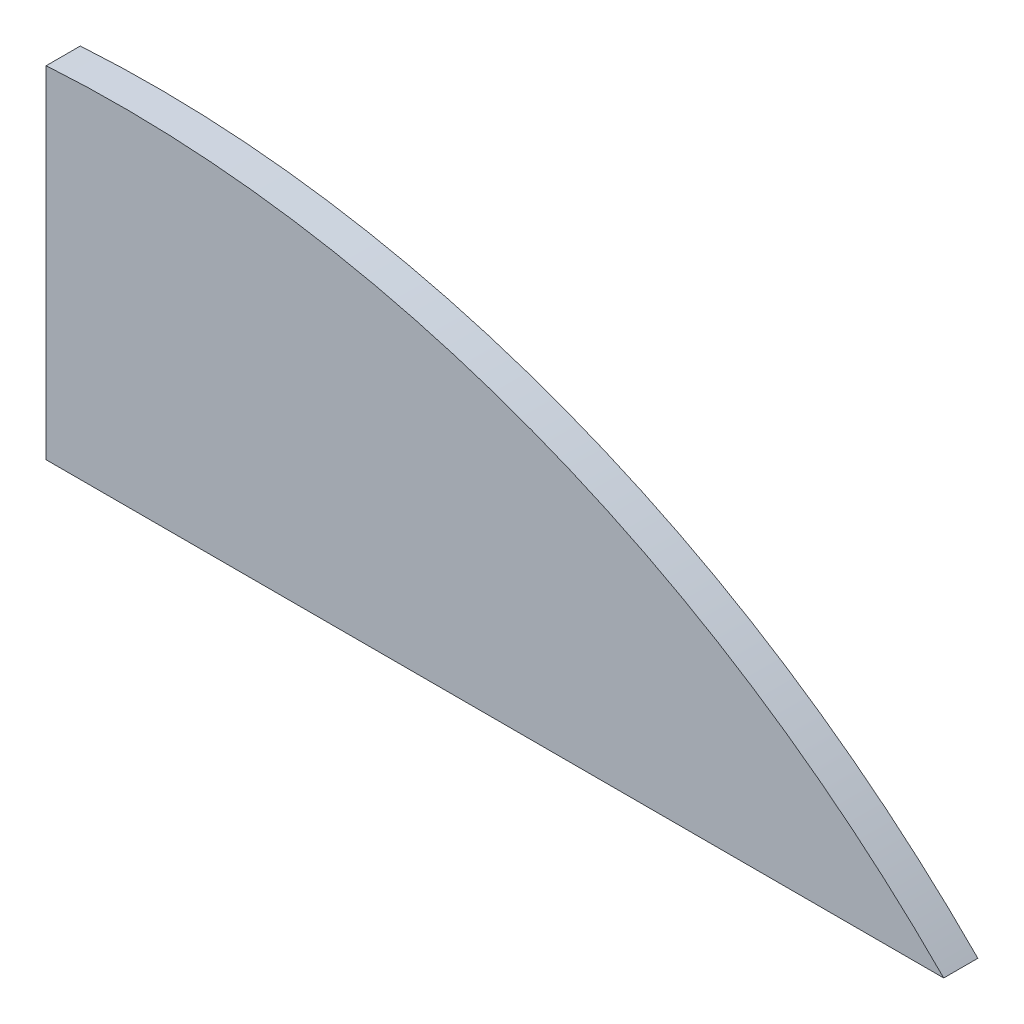
ISO-10303-21;
HEADER;
FILE_DESCRIPTION(('STEP AP214'),'2;1');
FILE_NAME('part.step','',(''),(''),'','','');
FILE_SCHEMA(('AUTOMOTIVE_DESIGN { 1 0 10303 214 1 1 1 1 }'));
ENDSEC;
DATA;
#1=APPLICATION_CONTEXT('core data for automotive mechanical design processes');
#2=APPLICATION_PROTOCOL_DEFINITION('international standard','automotive_design',2000,#1);
#3=PRODUCT_CONTEXT('',#1,'mechanical');
#4=PRODUCT('Part','Part','',(#3));
#5=PRODUCT_RELATED_PRODUCT_CATEGORY('part','',(#4));
#6=PRODUCT_DEFINITION_FORMATION('','',#4);
#7=PRODUCT_DEFINITION_CONTEXT('part definition',#1,'design');
#8=PRODUCT_DEFINITION('design','',#6,#7);
#9=PRODUCT_DEFINITION_SHAPE('','',#8);
#10=(LENGTH_UNIT() NAMED_UNIT(*) SI_UNIT(.MILLI.,.METRE.));
#11=(NAMED_UNIT(*) PLANE_ANGLE_UNIT() SI_UNIT($,.RADIAN.));
#12=(NAMED_UNIT(*) SI_UNIT($,.STERADIAN.) SOLID_ANGLE_UNIT());
#13=UNCERTAINTY_MEASURE_WITH_UNIT(LENGTH_MEASURE(1.E-05),#10,'distance_accuracy_value','');
#14=(GEOMETRIC_REPRESENTATION_CONTEXT(3) GLOBAL_UNCERTAINTY_ASSIGNED_CONTEXT((#13)) GLOBAL_UNIT_ASSIGNED_CONTEXT((#10,
#11,#12)) REPRESENTATION_CONTEXT('',''));
#15=CARTESIAN_POINT('',(0.,0.,0.));
#16=DIRECTION('',(0.,0.,1.));
#17=DIRECTION('',(1.,0.,0.));
#18=AXIS2_PLACEMENT_3D('',#15,#16,#17);
#19=CARTESIAN_POINT('',(0.,0.,1.));
#20=DIRECTION('',(0.,1.,0.));
#21=DIRECTION('',(0.,0.,1.));
#22=AXIS2_PLACEMENT_3D('',#19,#20,#21);
#23=PLANE('',#22);
#24=DIRECTION('',(1.,0.,0.));
#25=VECTOR('',#24,1.);
#26=CARTESIAN_POINT('',(0.,0.,0.));
#27=LINE('',#26,#25);
#28=CARTESIAN_POINT('',(0.,0.,0.));
#29=VERTEX_POINT('',#28);
#30=CARTESIAN_POINT('',(26.3,0.,0.));
#31=VERTEX_POINT('',#30);
#32=EDGE_CURVE('E80',#29,#31,#27,.T.);
#33=ORIENTED_EDGE('',*,*,#32,.T.);
#34=DIRECTION('',(0.,0.,-1.));
#35=VECTOR('',#34,1.);
#36=CARTESIAN_POINT('',(26.3,0.,1.));
#37=LINE('',#36,#35);
#38=CARTESIAN_POINT('',(26.3,0.,1.));
#39=VERTEX_POINT('',#38);
#40=EDGE_CURVE('E11',#39,#31,#37,.T.);
#41=ORIENTED_EDGE('',*,*,#40,.F.);
#42=DIRECTION('',(1.,0.,0.));
#43=VECTOR('',#42,1.);
#44=CARTESIAN_POINT('',(0.,0.,1.));
#45=LINE('',#44,#43);
#46=CARTESIAN_POINT('',(0.,0.,1.));
#47=VERTEX_POINT('',#46);
#48=EDGE_CURVE('E73',#47,#39,#45,.T.);
#49=ORIENTED_EDGE('',*,*,#48,.F.);
#50=DIRECTION('',(0.,0.,-1.));
#51=VECTOR('',#50,1.);
#52=CARTESIAN_POINT('',(0.,0.,1.));
#53=LINE('',#52,#51);
#54=EDGE_CURVE('E81',#47,#29,#53,.T.);
#55=ORIENTED_EDGE('',*,*,#54,.T.);
#56=EDGE_LOOP('',(#33,#41,#49,#55));
#57=FACE_BOUND('',#56,.T.);
#58=ADVANCED_FACE('F33',(#57),#23,.F.);
#59=CARTESIAN_POINT('',(2.2026758966562,-23.7914623917942,1.));
#60=DIRECTION('',(0.,0.,-1.));
#61=DIRECTION('',(-1.,0.,0.));
#62=AXIS2_PLACEMENT_3D('',#59,#60,#61);
#63=CYLINDRICAL_SURFACE('',#62,33.863176337753);
#64=CARTESIAN_POINT('',(2.2026758966562,-23.7914623917942,0.));
#65=DIRECTION('',(0.,0.,1.));
#66=DIRECTION('',(-1.,0.,0.));
#67=AXIS2_PLACEMENT_3D('',#64,#65,#66);
#68=CIRCLE('',#67,33.863176337753);
#69=CARTESIAN_POINT('',(0.,10.,0.));
#70=VERTEX_POINT('',#69);
#71=EDGE_CURVE('E61',#31,#70,#68,.T.);
#72=ORIENTED_EDGE('',*,*,#71,.T.);
#73=DIRECTION('',(0.,0.,-1.));
#74=VECTOR('',#73,1.);
#75=CARTESIAN_POINT('',(0.,10.,1.));
#76=LINE('',#75,#74);
#77=CARTESIAN_POINT('',(0.,10.,1.));
#78=VERTEX_POINT('',#77);
#79=EDGE_CURVE('E41',#78,#70,#76,.T.);
#80=ORIENTED_EDGE('',*,*,#79,.F.);
#81=CARTESIAN_POINT('',(2.2026758966562,-23.7914623917942,1.));
#82=DIRECTION('',(0.,0.,1.));
#83=DIRECTION('',(-1.,0.,0.));
#84=AXIS2_PLACEMENT_3D('',#81,#82,#83);
#85=CIRCLE('',#84,33.863176337753);
#86=EDGE_CURVE('E69',#39,#78,#85,.T.);
#87=ORIENTED_EDGE('',*,*,#86,.F.);
#88=ORIENTED_EDGE('',*,*,#40,.T.);
#89=EDGE_LOOP('',(#72,#80,#87,#88));
#90=FACE_BOUND('',#89,.T.);
#91=ADVANCED_FACE('F70',(#90),#63,.T.);
#92=CARTESIAN_POINT('',(0.,0.,1.));
#93=DIRECTION('',(1.,0.,0.));
#94=DIRECTION('',(0.,0.,-1.));
#95=AXIS2_PLACEMENT_3D('',#92,#93,#94);
#96=PLANE('',#95);
#97=DIRECTION('',(0.,-1.,0.));
#98=VECTOR('',#97,1.);
#99=CARTESIAN_POINT('',(0.,0.,0.));
#100=LINE('',#99,#98);
#101=EDGE_CURVE('E66',#70,#29,#100,.T.);
#102=ORIENTED_EDGE('',*,*,#101,.T.);
#103=ORIENTED_EDGE('',*,*,#54,.F.);
#104=DIRECTION('',(0.,-1.,0.));
#105=VECTOR('',#104,1.);
#106=CARTESIAN_POINT('',(0.,0.,1.));
#107=LINE('',#106,#105);
#108=EDGE_CURVE('E49',#78,#47,#107,.T.);
#109=ORIENTED_EDGE('',*,*,#108,.F.);
#110=ORIENTED_EDGE('',*,*,#79,.T.);
#111=EDGE_LOOP('',(#102,#103,#109,#110));
#112=FACE_BOUND('',#111,.T.);
#113=ADVANCED_FACE('F88',(#112),#96,.F.);
#114=CARTESIAN_POINT('',(2.2026758966562,-23.7914623917942,1.));
#115=DIRECTION('',(0.,0.,-1.));
#116=DIRECTION('',(-1.,0.,0.));
#117=AXIS2_PLACEMENT_3D('',#114,#115,#116);
#118=PLANE('',#117);
#119=ORIENTED_EDGE('',*,*,#48,.T.);
#120=ORIENTED_EDGE('',*,*,#86,.T.);
#121=ORIENTED_EDGE('',*,*,#108,.T.);
#122=EDGE_LOOP('',(#119,#120,#121));
#123=FACE_BOUND('',#122,.T.);
#124=ADVANCED_FACE('F76',(#123),#118,.F.);
#125=CARTESIAN_POINT('',(2.2026758966562,-23.7914623917942,0.));
#126=DIRECTION('',(0.,0.,-1.));
#127=DIRECTION('',(-1.,0.,0.));
#128=AXIS2_PLACEMENT_3D('',#125,#126,#127);
#129=PLANE('',#128);
#130=ORIENTED_EDGE('',*,*,#32,.F.);
#131=ORIENTED_EDGE('',*,*,#101,.F.);
#132=ORIENTED_EDGE('',*,*,#71,.F.);
#133=EDGE_LOOP('',(#130,#131,#132));
#134=FACE_BOUND('',#133,.T.);
#135=ADVANCED_FACE('F89',(#134),#129,.T.);
#136=CLOSED_SHELL('',(#58,#91,#113,#124,#135));
#137=MANIFOLD_SOLID_BREP('B2',#136);
#138=ADVANCED_BREP_SHAPE_REPRESENTATION('',(#18,#137),#14);
#139=SHAPE_DEFINITION_REPRESENTATION(#9,#138);
ENDSEC;
END-ISO-10303-21;
